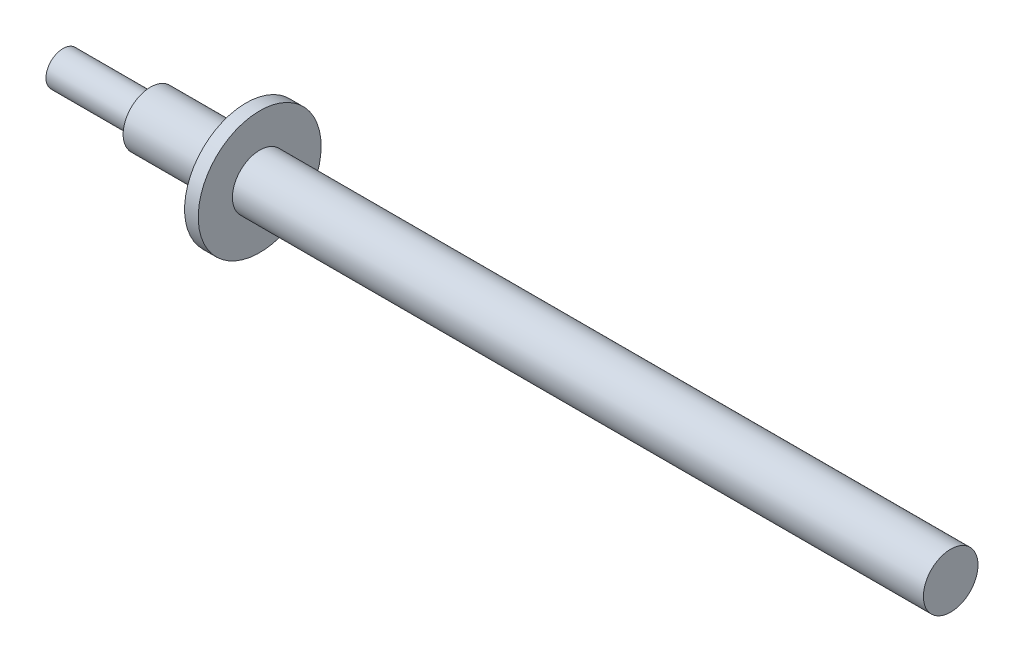
ISO-10303-21;
HEADER;
FILE_DESCRIPTION(('STEP AP214'),'2;1');
FILE_NAME('part.step','',(''),(''),'','','');
FILE_SCHEMA(('AUTOMOTIVE_DESIGN { 1 0 10303 214 1 1 1 1 }'));
ENDSEC;
DATA;
#1=APPLICATION_CONTEXT('core data for automotive mechanical design processes');
#2=APPLICATION_PROTOCOL_DEFINITION('international standard','automotive_design',2000,#1);
#3=PRODUCT_CONTEXT('',#1,'mechanical');
#4=PRODUCT('Part','Part','',(#3));
#5=PRODUCT_RELATED_PRODUCT_CATEGORY('part','',(#4));
#6=PRODUCT_DEFINITION_FORMATION('','',#4);
#7=PRODUCT_DEFINITION_CONTEXT('part definition',#1,'design');
#8=PRODUCT_DEFINITION('design','',#6,#7);
#9=PRODUCT_DEFINITION_SHAPE('','',#8);
#10=(LENGTH_UNIT() NAMED_UNIT(*) SI_UNIT(.MILLI.,.METRE.));
#11=(NAMED_UNIT(*) PLANE_ANGLE_UNIT() SI_UNIT($,.RADIAN.));
#12=(NAMED_UNIT(*) SI_UNIT($,.STERADIAN.) SOLID_ANGLE_UNIT());
#13=UNCERTAINTY_MEASURE_WITH_UNIT(LENGTH_MEASURE(1.E-05),#10,'distance_accuracy_value','');
#14=(GEOMETRIC_REPRESENTATION_CONTEXT(3) GLOBAL_UNCERTAINTY_ASSIGNED_CONTEXT((#13)) GLOBAL_UNIT_ASSIGNED_CONTEXT((#10,
#11,#12)) REPRESENTATION_CONTEXT('',''));
#15=CARTESIAN_POINT('',(0.,0.,0.));
#16=DIRECTION('',(0.,0.,1.));
#17=DIRECTION('',(1.,0.,0.));
#18=AXIS2_PLACEMENT_3D('',#15,#16,#17);
#19=CARTESIAN_POINT('',(65.,0.,0.));
#20=DIRECTION('',(-1.,0.,0.));
#21=DIRECTION('',(0.,0.,1.));
#22=AXIS2_PLACEMENT_3D('',#19,#20,#21);
#23=CYLINDRICAL_SURFACE('',#22,2.);
#24=CARTESIAN_POINT('',(14.4,0.,0.));
#25=DIRECTION('',(1.,0.,0.));
#26=DIRECTION('',(0.,0.,-1.));
#27=AXIS2_PLACEMENT_3D('',#24,#25,#26);
#28=CIRCLE('',#27,2.);
#29=CARTESIAN_POINT('',(14.4,0.,-2.));
#30=VERTEX_POINT('',#29);
#31=EDGE_CURVE('E49',#30,#30,#28,.T.);
#32=ORIENTED_EDGE('',*,*,#31,.T.);
#33=EDGE_LOOP('',(#32));
#34=FACE_BOUND('',#33,.T.);
#35=CARTESIAN_POINT('',(65.,0.,0.));
#36=DIRECTION('',(1.,0.,0.));
#37=DIRECTION('',(0.,0.,-1.));
#38=AXIS2_PLACEMENT_3D('',#35,#36,#37);
#39=CIRCLE('',#38,2.);
#40=CARTESIAN_POINT('',(65.,0.,-2.));
#41=VERTEX_POINT('',#40);
#42=EDGE_CURVE('E53',#41,#41,#39,.T.);
#43=ORIENTED_EDGE('',*,*,#42,.F.);
#44=EDGE_LOOP('',(#43));
#45=FACE_BOUND('',#44,.T.);
#46=ADVANCED_FACE('F46',(#34,#45),#23,.T.);
#47=CARTESIAN_POINT('',(65.,0.,0.));
#48=DIRECTION('',(1.,0.,0.));
#49=DIRECTION('',(0.,0.,-1.));
#50=AXIS2_PLACEMENT_3D('',#47,#48,#49);
#51=PLANE('',#50);
#52=ORIENTED_EDGE('',*,*,#42,.T.);
#53=EDGE_LOOP('',(#52));
#54=FACE_BOUND('',#53,.T.);
#55=ADVANCED_FACE('F89',(#54),#51,.T.);
#56=CARTESIAN_POINT('',(14.4,0.,0.));
#57=DIRECTION('',(-1.,0.,0.));
#58=DIRECTION('',(0.,0.,1.));
#59=AXIS2_PLACEMENT_3D('',#56,#57,#58);
#60=CYLINDRICAL_SURFACE('',#59,4.5);
#61=CARTESIAN_POINT('',(14.4,0.,0.));
#62=DIRECTION('',(1.,0.,0.));
#63=DIRECTION('',(0.,0.,-1.));
#64=AXIS2_PLACEMENT_3D('',#61,#62,#63);
#65=CIRCLE('',#64,4.5);
#66=CARTESIAN_POINT('',(14.4,0.,-4.5));
#67=VERTEX_POINT('',#66);
#68=EDGE_CURVE('E62',#67,#67,#65,.T.);
#69=ORIENTED_EDGE('',*,*,#68,.F.);
#70=EDGE_LOOP('',(#69));
#71=FACE_BOUND('',#70,.T.);
#72=CARTESIAN_POINT('',(13.4,0.,0.));
#73=DIRECTION('',(1.,0.,0.));
#74=DIRECTION('',(0.,0.,-1.));
#75=AXIS2_PLACEMENT_3D('',#72,#73,#74);
#76=CIRCLE('',#75,4.5);
#77=CARTESIAN_POINT('',(13.4,0.,-4.5));
#78=VERTEX_POINT('',#77);
#79=EDGE_CURVE('E59',#78,#78,#76,.T.);
#80=ORIENTED_EDGE('',*,*,#79,.T.);
#81=EDGE_LOOP('',(#80));
#82=FACE_BOUND('',#81,.T.);
#83=ADVANCED_FACE('F95',(#71,#82),#60,.T.);
#84=CARTESIAN_POINT('',(14.4,0.,0.));
#85=DIRECTION('',(1.,0.,0.));
#86=DIRECTION('',(0.,0.,-1.));
#87=AXIS2_PLACEMENT_3D('',#84,#85,#86);
#88=PLANE('',#87);
#89=ORIENTED_EDGE('',*,*,#31,.F.);
#90=EDGE_LOOP('',(#89));
#91=FACE_BOUND('',#90,.T.);
#92=ORIENTED_EDGE('',*,*,#68,.T.);
#93=EDGE_LOOP('',(#92));
#94=FACE_BOUND('',#93,.T.);
#95=ADVANCED_FACE('F108',(#91,#94),#88,.T.);
#96=CARTESIAN_POINT('',(13.4,0.,0.));
#97=DIRECTION('',(1.,0.,0.));
#98=DIRECTION('',(0.,0.,-1.));
#99=AXIS2_PLACEMENT_3D('',#96,#97,#98);
#100=PLANE('',#99);
#101=CARTESIAN_POINT('',(13.4,0.,0.));
#102=DIRECTION('',(1.,0.,0.));
#103=DIRECTION('',(0.,0.,-1.));
#104=AXIS2_PLACEMENT_3D('',#101,#102,#103);
#105=CIRCLE('',#104,2.);
#106=CARTESIAN_POINT('',(13.4,0.,-2.));
#107=VERTEX_POINT('',#106);
#108=EDGE_CURVE('E12',#107,#107,#105,.T.);
#109=ORIENTED_EDGE('',*,*,#108,.T.);
#110=EDGE_LOOP('',(#109));
#111=FACE_BOUND('',#110,.T.);
#112=ORIENTED_EDGE('',*,*,#79,.F.);
#113=EDGE_LOOP('',(#112));
#114=FACE_BOUND('',#113,.T.);
#115=ADVANCED_FACE('F100',(#111,#114),#100,.F.);
#116=CARTESIAN_POINT('',(6.4,0.,0.));
#117=DIRECTION('',(1.,0.,0.));
#118=DIRECTION('',(0.,0.,-1.));
#119=AXIS2_PLACEMENT_3D('',#116,#117,#118);
#120=CIRCLE('',#119,2.);
#121=CARTESIAN_POINT('',(6.4,0.,-2.));
#122=VERTEX_POINT('',#121);
#123=EDGE_CURVE('E63',#122,#122,#120,.T.);
#124=ORIENTED_EDGE('',*,*,#123,.T.);
#125=EDGE_LOOP('',(#124));
#126=FACE_BOUND('',#125,.T.);
#127=ORIENTED_EDGE('',*,*,#108,.F.);
#128=EDGE_LOOP('',(#127));
#129=FACE_BOUND('',#128,.T.);
#130=ADVANCED_FACE('F91',(#126,#129),#23,.T.);
#131=CARTESIAN_POINT('',(6.4,0.,0.));
#132=DIRECTION('',(1.,0.,0.));
#133=DIRECTION('',(0.,0.,-1.));
#134=AXIS2_PLACEMENT_3D('',#131,#132,#133);
#135=PLANE('',#134);
#136=ORIENTED_EDGE('',*,*,#123,.F.);
#137=EDGE_LOOP('',(#136));
#138=FACE_BOUND('',#137,.T.);
#139=CARTESIAN_POINT('',(6.4,0.,0.));
#140=DIRECTION('',(1.,0.,0.));
#141=DIRECTION('',(0.,0.,-1.));
#142=AXIS2_PLACEMENT_3D('',#139,#140,#141);
#143=CIRCLE('',#142,1.25);
#144=CARTESIAN_POINT('',(6.4,0.,-1.25));
#145=VERTEX_POINT('',#144);
#146=EDGE_CURVE('E68',#145,#145,#143,.T.);
#147=ORIENTED_EDGE('',*,*,#146,.T.);
#148=EDGE_LOOP('',(#147));
#149=FACE_BOUND('',#148,.T.);
#150=ADVANCED_FACE('F75',(#138,#149),#135,.F.);
#151=CARTESIAN_POINT('',(6.4,0.,0.));
#152=DIRECTION('',(-1.,0.,0.));
#153=DIRECTION('',(0.,0.,1.));
#154=AXIS2_PLACEMENT_3D('',#151,#152,#153);
#155=CYLINDRICAL_SURFACE('',#154,1.25);
#156=ORIENTED_EDGE('',*,*,#146,.F.);
#157=EDGE_LOOP('',(#156));
#158=FACE_BOUND('',#157,.T.);
#159=CARTESIAN_POINT('',(0.,0.,0.));
#160=DIRECTION('',(1.,0.,0.));
#161=DIRECTION('',(0.,0.,-1.));
#162=AXIS2_PLACEMENT_3D('',#159,#160,#161);
#163=CIRCLE('',#162,1.25);
#164=CARTESIAN_POINT('',(0.,0.,-1.25));
#165=VERTEX_POINT('',#164);
#166=EDGE_CURVE('E69',#165,#165,#163,.T.);
#167=ORIENTED_EDGE('',*,*,#166,.T.);
#168=EDGE_LOOP('',(#167));
#169=FACE_BOUND('',#168,.T.);
#170=ADVANCED_FACE('F77',(#158,#169),#155,.T.);
#171=CARTESIAN_POINT('',(0.,0.,0.));
#172=DIRECTION('',(1.,0.,0.));
#173=DIRECTION('',(0.,0.,-1.));
#174=AXIS2_PLACEMENT_3D('',#171,#172,#173);
#175=PLANE('',#174);
#176=ORIENTED_EDGE('',*,*,#166,.F.);
#177=EDGE_LOOP('',(#176));
#178=FACE_BOUND('',#177,.T.);
#179=ADVANCED_FACE('F80',(#178),#175,.F.);
#180=CLOSED_SHELL('',(#46,#55,#83,#95,#115,#130,#150,#170,#179));
#181=MANIFOLD_SOLID_BREP('B2',#180);
#182=ADVANCED_BREP_SHAPE_REPRESENTATION('',(#18,#181),#14);
#183=SHAPE_DEFINITION_REPRESENTATION(#9,#182);
ENDSEC;
END-ISO-10303-21;
